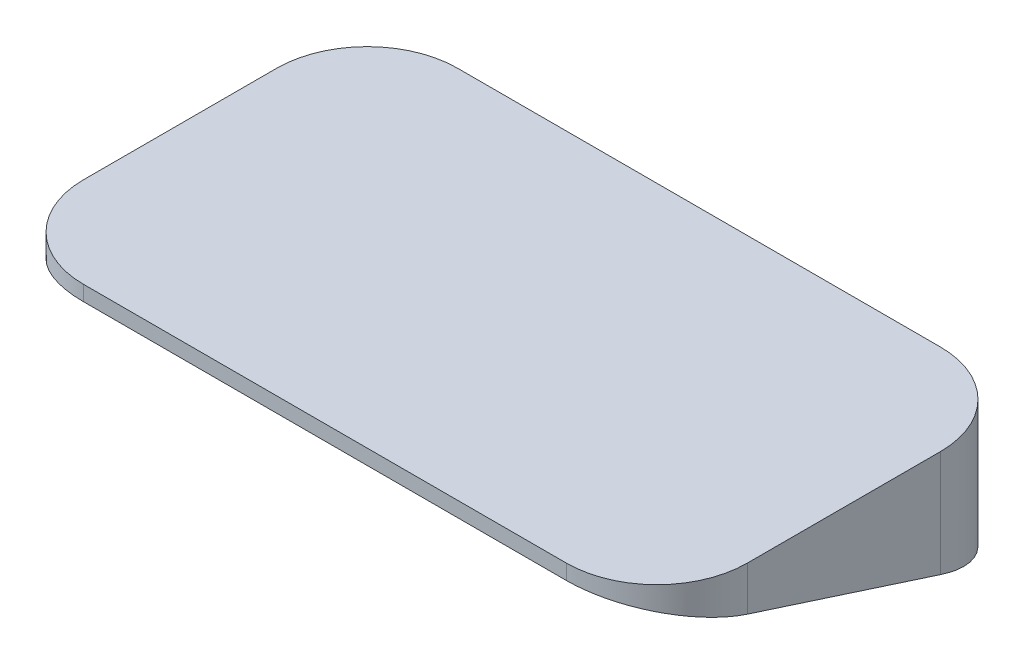
ISO-10303-21;
HEADER;
FILE_DESCRIPTION(('STEP AP214'),'2;1');
FILE_NAME('part.step','',(''),(''),'','','');
FILE_SCHEMA(('AUTOMOTIVE_DESIGN { 1 0 10303 214 1 1 1 1 }'));
ENDSEC;
DATA;
#1=APPLICATION_CONTEXT('core data for automotive mechanical design processes');
#2=APPLICATION_PROTOCOL_DEFINITION('international standard','automotive_design',2000,#1);
#3=PRODUCT_CONTEXT('',#1,'mechanical');
#4=PRODUCT('Part','Part','',(#3));
#5=PRODUCT_RELATED_PRODUCT_CATEGORY('part','',(#4));
#6=PRODUCT_DEFINITION_FORMATION('','',#4);
#7=PRODUCT_DEFINITION_CONTEXT('part definition',#1,'design');
#8=PRODUCT_DEFINITION('design','',#6,#7);
#9=PRODUCT_DEFINITION_SHAPE('','',#8);
#10=(LENGTH_UNIT() NAMED_UNIT(*) SI_UNIT(.MILLI.,.METRE.));
#11=(NAMED_UNIT(*) PLANE_ANGLE_UNIT() SI_UNIT($,.RADIAN.));
#12=(NAMED_UNIT(*) SI_UNIT($,.STERADIAN.) SOLID_ANGLE_UNIT());
#13=UNCERTAINTY_MEASURE_WITH_UNIT(LENGTH_MEASURE(1.E-05),#10,'distance_accuracy_value','');
#14=(GEOMETRIC_REPRESENTATION_CONTEXT(3) GLOBAL_UNCERTAINTY_ASSIGNED_CONTEXT((#13)) GLOBAL_UNIT_ASSIGNED_CONTEXT((#10,
#11,#12)) REPRESENTATION_CONTEXT('',''));
#15=CARTESIAN_POINT('',(0.,0.,0.));
#16=DIRECTION('',(0.,0.,1.));
#17=DIRECTION('',(1.,0.,0.));
#18=AXIS2_PLACEMENT_3D('',#15,#16,#17);
#19=CARTESIAN_POINT('',(80.,45.,32.));
#20=DIRECTION('',(0.,-1.,0.));
#21=DIRECTION('',(0.,0.,-1.));
#22=AXIS2_PLACEMENT_3D('',#19,#20,#21);
#23=CYLINDRICAL_SURFACE('',#22,30.);
#24=CARTESIAN_POINT('',(80.,30.3225806451613,32.));
#25=DIRECTION('',(0.,-0.951708617760551,0.307002779922758));
#26=DIRECTION('',(0.,-0.307002779922758,-0.951708617760551));
#27=AXIS2_PLACEMENT_3D('',#24,#25,#26);
#28=ELLIPSE('',#27,31.5222531772303,30.);
#29=CARTESIAN_POINT('',(110.,30.3225806451612,31.9999999999998));
#30=VERTEX_POINT('',#29);
#31=CARTESIAN_POINT('',(79.9999999999998,40.,62.));
#32=VERTEX_POINT('',#31);
#33=EDGE_CURVE('E161',#30,#32,#28,.T.);
#34=ORIENTED_EDGE('',*,*,#33,.F.);
#35=DIRECTION('',(0.,-1.,0.));
#36=VECTOR('',#35,1.);
#37=CARTESIAN_POINT('',(110.,45.,31.9999999999998));
#38=LINE('',#37,#36);
#39=CARTESIAN_POINT('',(110.,45.,31.9999999999998));
#40=VERTEX_POINT('',#39);
#41=EDGE_CURVE('E40',#40,#30,#38,.T.);
#42=ORIENTED_EDGE('',*,*,#41,.F.);
#43=CARTESIAN_POINT('',(80.,45.,32.));
#44=DIRECTION('',(0.,1.,0.));
#45=DIRECTION('',(0.,0.,1.));
#46=AXIS2_PLACEMENT_3D('',#43,#44,#45);
#47=CIRCLE('',#46,30.);
#48=CARTESIAN_POINT('',(79.9999999999998,45.,62.));
#49=VERTEX_POINT('',#48);
#50=EDGE_CURVE('E131',#49,#40,#47,.T.);
#51=ORIENTED_EDGE('',*,*,#50,.F.);
#52=DIRECTION('',(0.,-1.,0.));
#53=VECTOR('',#52,1.);
#54=CARTESIAN_POINT('',(79.9999999999998,45.,62.));
#55=LINE('',#54,#53);
#56=EDGE_CURVE('E125',#49,#32,#55,.T.);
#57=ORIENTED_EDGE('',*,*,#56,.T.);
#58=EDGE_LOOP('',(#34,#42,#51,#57));
#59=FACE_BOUND('',#58,.T.);
#60=ADVANCED_FACE('F33',(#59),#23,.T.);
#61=CARTESIAN_POINT('',(110.,45.,-31.9999999999998));
#62=DIRECTION('',(-1.,0.,0.));
#63=DIRECTION('',(0.,0.,1.));
#64=AXIS2_PLACEMENT_3D('',#61,#62,#63);
#65=PLANE('',#64);
#66=DIRECTION('',(0.,-0.307002779922758,-0.951708617760551));
#67=VECTOR('',#66,1.);
#68=CARTESIAN_POINT('',(110.,18.114985862394,-5.84354382657873));
#69=LINE('',#68,#67);
#70=CARTESIAN_POINT('',(110.,9.67741935483871,-32.));
#71=VERTEX_POINT('',#70);
#72=EDGE_CURVE('E153',#30,#71,#69,.T.);
#73=ORIENTED_EDGE('',*,*,#72,.T.);
#74=DIRECTION('',(0.,-1.,0.));
#75=VECTOR('',#74,1.);
#76=CARTESIAN_POINT('',(110.,45.,-31.9999999999998));
#77=LINE('',#76,#75);
#78=CARTESIAN_POINT('',(110.,45.,-31.9999999999998));
#79=VERTEX_POINT('',#78);
#80=EDGE_CURVE('E142',#79,#71,#77,.T.);
#81=ORIENTED_EDGE('',*,*,#80,.F.);
#82=DIRECTION('',(0.,0.,-1.));
#83=VECTOR('',#82,1.);
#84=CARTESIAN_POINT('',(110.,45.,-31.9999999999998));
#85=LINE('',#84,#83);
#86=EDGE_CURVE('E154',#40,#79,#85,.T.);
#87=ORIENTED_EDGE('',*,*,#86,.F.);
#88=ORIENTED_EDGE('',*,*,#41,.T.);
#89=EDGE_LOOP('',(#73,#81,#87,#88));
#90=FACE_BOUND('',#89,.T.);
#91=ADVANCED_FACE('F149',(#90),#65,.F.);
#92=CARTESIAN_POINT('',(80.,45.,-32.));
#93=DIRECTION('',(0.,-1.,0.));
#94=DIRECTION('',(0.,0.,-1.));
#95=AXIS2_PLACEMENT_3D('',#92,#93,#94);
#96=CYLINDRICAL_SURFACE('',#95,30.);
#97=CARTESIAN_POINT('',(80.,9.67741935483871,-32.));
#98=DIRECTION('',(0.,-0.951708617760551,0.307002779922758));
#99=DIRECTION('',(0.,-0.307002779922758,-0.951708617760551));
#100=AXIS2_PLACEMENT_3D('',#97,#98,#99);
#101=ELLIPSE('',#100,31.5222531772303,30.);
#102=CARTESIAN_POINT('',(79.9999999999998,0.,-62.));
#103=VERTEX_POINT('',#102);
#104=EDGE_CURVE('E166',#103,#71,#101,.T.);
#105=ORIENTED_EDGE('',*,*,#104,.F.);
#106=DIRECTION('',(0.,-1.,0.));
#107=VECTOR('',#106,1.);
#108=CARTESIAN_POINT('',(79.9999999999998,45.,-62.));
#109=LINE('',#108,#107);
#110=CARTESIAN_POINT('',(79.9999999999998,45.,-62.));
#111=VERTEX_POINT('',#110);
#112=EDGE_CURVE('E139',#111,#103,#109,.T.);
#113=ORIENTED_EDGE('',*,*,#112,.F.);
#114=CARTESIAN_POINT('',(80.,45.,-32.));
#115=DIRECTION('',(0.,1.,0.));
#116=DIRECTION('',(0.,0.,-1.));
#117=AXIS2_PLACEMENT_3D('',#114,#115,#116);
#118=CIRCLE('',#117,30.);
#119=EDGE_CURVE('E219',#79,#111,#118,.T.);
#120=ORIENTED_EDGE('',*,*,#119,.F.);
#121=ORIENTED_EDGE('',*,*,#80,.T.);
#122=EDGE_LOOP('',(#105,#113,#120,#121));
#123=FACE_BOUND('',#122,.T.);
#124=ADVANCED_FACE('F326',(#123),#96,.T.);
#125=CARTESIAN_POINT('',(-80.,45.,-32.));
#126=DIRECTION('',(0.,-1.,0.));
#127=DIRECTION('',(0.,0.,-1.));
#128=AXIS2_PLACEMENT_3D('',#125,#126,#127);
#129=CYLINDRICAL_SURFACE('',#128,30.);
#130=CARTESIAN_POINT('',(-80.,9.6774193548387,-32.));
#131=DIRECTION('',(0.,-0.951708617760551,0.307002779922758));
#132=DIRECTION('',(0.,-0.307002779922758,-0.951708617760551));
#133=AXIS2_PLACEMENT_3D('',#130,#131,#132);
#134=ELLIPSE('',#133,31.5222531772303,30.);
#135=CARTESIAN_POINT('',(-110.,9.67741935483876,-31.9999999999998));
#136=VERTEX_POINT('',#135);
#137=CARTESIAN_POINT('',(-79.9999999999998,0.,-62.));
#138=VERTEX_POINT('',#137);
#139=EDGE_CURVE('E68',#136,#138,#134,.T.);
#140=ORIENTED_EDGE('',*,*,#139,.F.);
#141=DIRECTION('',(0.,-1.,0.));
#142=VECTOR('',#141,1.);
#143=CARTESIAN_POINT('',(-110.,45.,-31.9999999999998));
#144=LINE('',#143,#142);
#145=CARTESIAN_POINT('',(-110.,45.,-31.9999999999998));
#146=VERTEX_POINT('',#145);
#147=EDGE_CURVE('E119',#146,#136,#144,.T.);
#148=ORIENTED_EDGE('',*,*,#147,.F.);
#149=CARTESIAN_POINT('',(-80.,45.,-32.));
#150=DIRECTION('',(0.,1.,0.));
#151=DIRECTION('',(0.,0.,1.));
#152=AXIS2_PLACEMENT_3D('',#149,#150,#151);
#153=CIRCLE('',#152,30.);
#154=CARTESIAN_POINT('',(-79.9999999999998,45.,-62.));
#155=VERTEX_POINT('',#154);
#156=EDGE_CURVE('E106',#155,#146,#153,.T.);
#157=ORIENTED_EDGE('',*,*,#156,.F.);
#158=DIRECTION('',(0.,-1.,0.));
#159=VECTOR('',#158,1.);
#160=CARTESIAN_POINT('',(-79.9999999999998,45.,-62.));
#161=LINE('',#160,#159);
#162=EDGE_CURVE('E136',#155,#138,#161,.T.);
#163=ORIENTED_EDGE('',*,*,#162,.T.);
#164=EDGE_LOOP('',(#140,#148,#157,#163));
#165=FACE_BOUND('',#164,.T.);
#166=ADVANCED_FACE('F229',(#165),#129,.T.);
#167=CARTESIAN_POINT('',(-110.,45.,-31.9999999999998));
#168=DIRECTION('',(1.,0.,0.));
#169=DIRECTION('',(0.,0.,-1.));
#170=AXIS2_PLACEMENT_3D('',#167,#168,#169);
#171=PLANE('',#170);
#172=DIRECTION('',(0.,-0.307002779922758,-0.951708617760551));
#173=VECTOR('',#172,1.);
#174=CARTESIAN_POINT('',(-110.,13.0065975494817,-21.6795475966068));
#175=LINE('',#174,#173);
#176=CARTESIAN_POINT('',(-110.,30.3225806451612,31.9999999999998));
#177=VERTEX_POINT('',#176);
#178=EDGE_CURVE('E116',#177,#136,#175,.T.);
#179=ORIENTED_EDGE('',*,*,#178,.F.);
#180=DIRECTION('',(0.,-1.,0.));
#181=VECTOR('',#180,1.);
#182=CARTESIAN_POINT('',(-110.,45.,31.9999999999998));
#183=LINE('',#182,#181);
#184=CARTESIAN_POINT('',(-110.,45.,31.9999999999998));
#185=VERTEX_POINT('',#184);
#186=EDGE_CURVE('E113',#185,#177,#183,.T.);
#187=ORIENTED_EDGE('',*,*,#186,.F.);
#188=DIRECTION('',(0.,0.,1.));
#189=VECTOR('',#188,1.);
#190=CARTESIAN_POINT('',(-110.,45.,-31.9999999999998));
#191=LINE('',#190,#189);
#192=EDGE_CURVE('E99',#146,#185,#191,.T.);
#193=ORIENTED_EDGE('',*,*,#192,.F.);
#194=ORIENTED_EDGE('',*,*,#147,.T.);
#195=EDGE_LOOP('',(#179,#187,#193,#194));
#196=FACE_BOUND('',#195,.T.);
#197=ADVANCED_FACE('F114',(#196),#171,.F.);
#198=CARTESIAN_POINT('',(-80.,45.,32.));
#199=DIRECTION('',(0.,-1.,0.));
#200=DIRECTION('',(0.,0.,-1.));
#201=AXIS2_PLACEMENT_3D('',#198,#199,#200);
#202=CYLINDRICAL_SURFACE('',#201,30.);
#203=CARTESIAN_POINT('',(-80.,30.3225806451613,32.));
#204=DIRECTION('',(0.,-0.951708617760551,0.307002779922758));
#205=DIRECTION('',(0.,-0.307002779922758,-0.951708617760551));
#206=AXIS2_PLACEMENT_3D('',#203,#204,#205);
#207=ELLIPSE('',#206,31.5222531772303,30.);
#208=CARTESIAN_POINT('',(-79.9999999999998,40.,62.));
#209=VERTEX_POINT('',#208);
#210=EDGE_CURVE('E290',#209,#177,#207,.T.);
#211=ORIENTED_EDGE('',*,*,#210,.F.);
#212=DIRECTION('',(0.,-1.,0.));
#213=VECTOR('',#212,1.);
#214=CARTESIAN_POINT('',(-79.9999999999998,45.,62.));
#215=LINE('',#214,#213);
#216=CARTESIAN_POINT('',(-79.9999999999998,45.,62.));
#217=VERTEX_POINT('',#216);
#218=EDGE_CURVE('E120',#217,#209,#215,.T.);
#219=ORIENTED_EDGE('',*,*,#218,.F.);
#220=CARTESIAN_POINT('',(-80.,45.,32.));
#221=DIRECTION('',(0.,1.,0.));
#222=DIRECTION('',(0.,0.,1.));
#223=AXIS2_PLACEMENT_3D('',#220,#221,#222);
#224=CIRCLE('',#223,30.);
#225=EDGE_CURVE('E103',#185,#217,#224,.T.);
#226=ORIENTED_EDGE('',*,*,#225,.F.);
#227=ORIENTED_EDGE('',*,*,#186,.T.);
#228=EDGE_LOOP('',(#211,#219,#226,#227));
#229=FACE_BOUND('',#228,.T.);
#230=ADVANCED_FACE('F122',(#229),#202,.T.);
#231=CARTESIAN_POINT('',(-79.9999999999998,45.,62.));
#232=DIRECTION('',(0.,0.,-1.));
#233=DIRECTION('',(-1.,0.,0.));
#234=AXIS2_PLACEMENT_3D('',#231,#232,#233);
#235=PLANE('',#234);
#236=DIRECTION('',(1.,0.,0.));
#237=VECTOR('',#236,1.);
#238=CARTESIAN_POINT('',(-154.,40.,62.));
#239=LINE('',#238,#237);
#240=EDGE_CURVE('E308',#209,#32,#239,.T.);
#241=ORIENTED_EDGE('',*,*,#240,.T.);
#242=ORIENTED_EDGE('',*,*,#56,.F.);
#243=DIRECTION('',(1.,0.,0.));
#244=VECTOR('',#243,1.);
#245=CARTESIAN_POINT('',(-79.9999999999998,45.,62.));
#246=LINE('',#245,#244);
#247=EDGE_CURVE('E55',#217,#49,#246,.T.);
#248=ORIENTED_EDGE('',*,*,#247,.F.);
#249=ORIENTED_EDGE('',*,*,#218,.T.);
#250=EDGE_LOOP('',(#241,#242,#248,#249));
#251=FACE_BOUND('',#250,.T.);
#252=ADVANCED_FACE('F318',(#251),#235,.F.);
#253=CARTESIAN_POINT('',(-79.9999999999998,45.,-62.));
#254=DIRECTION('',(0.,0.,1.));
#255=DIRECTION('',(1.,0.,0.));
#256=AXIS2_PLACEMENT_3D('',#253,#254,#255);
#257=PLANE('',#256);
#258=DIRECTION('',(-1.,0.,0.));
#259=VECTOR('',#258,1.);
#260=CARTESIAN_POINT('',(-79.9999999999998,0.,-62.));
#261=LINE('',#260,#259);
#262=EDGE_CURVE('E129',#103,#138,#261,.T.);
#263=ORIENTED_EDGE('',*,*,#262,.T.);
#264=ORIENTED_EDGE('',*,*,#162,.F.);
#265=DIRECTION('',(-1.,0.,0.));
#266=VECTOR('',#265,1.);
#267=CARTESIAN_POINT('',(-79.9999999999998,45.,-62.));
#268=LINE('',#267,#266);
#269=EDGE_CURVE('E221',#111,#155,#268,.T.);
#270=ORIENTED_EDGE('',*,*,#269,.F.);
#271=ORIENTED_EDGE('',*,*,#112,.T.);
#272=EDGE_LOOP('',(#263,#264,#270,#271));
#273=FACE_BOUND('',#272,.T.);
#274=ADVANCED_FACE('F227',(#273),#257,.F.);
#275=CARTESIAN_POINT('',(80.,45.,32.));
#276=DIRECTION('',(0.,1.,0.));
#277=DIRECTION('',(0.,0.,1.));
#278=AXIS2_PLACEMENT_3D('',#275,#276,#277);
#279=PLANE('',#278);
#280=ORIENTED_EDGE('',*,*,#50,.T.);
#281=ORIENTED_EDGE('',*,*,#86,.T.);
#282=ORIENTED_EDGE('',*,*,#119,.T.);
#283=ORIENTED_EDGE('',*,*,#269,.T.);
#284=ORIENTED_EDGE('',*,*,#156,.T.);
#285=ORIENTED_EDGE('',*,*,#192,.T.);
#286=ORIENTED_EDGE('',*,*,#225,.T.);
#287=ORIENTED_EDGE('',*,*,#247,.T.);
#288=EDGE_LOOP('',(#280,#281,#282,#283,#284,#285,#286,#287));
#289=FACE_BOUND('',#288,.T.);
#290=ADVANCED_FACE('F101',(#289),#279,.T.);
#291=CARTESIAN_POINT('',(-154.,18.114985862394,-5.84354382657867));
#292=DIRECTION('',(0.,-0.951708617760551,0.307002779922758));
#293=DIRECTION('',(0.,-0.307002779922758,-0.951708617760551));
#294=AXIS2_PLACEMENT_3D('',#291,#292,#293);
#295=PLANE('',#294);
#296=CARTESIAN_POINT('',(80.,30.3225806451613,32.));
#297=DIRECTION('',(0.,-0.951708617760551,0.307002779922758));
#298=DIRECTION('',(0.,-0.307002779922758,-0.951708617760551));
#299=AXIS2_PLACEMENT_3D('',#296,#297,#298);
#300=ELLIPSE('',#299,29.4207696320816,28.);
#301=CARTESIAN_POINT('',(79.9999999999998,39.3548387096774,60.));
#302=VERTEX_POINT('',#301);
#303=CARTESIAN_POINT('',(108.,30.3225806451612,31.9999999999998));
#304=VERTEX_POINT('',#303);
#305=EDGE_CURVE('E285',#302,#304,#300,.F.);
#306=ORIENTED_EDGE('',*,*,#305,.T.);
#307=DIRECTION('',(0.,-0.307002779922758,-0.951708617760551));
#308=VECTOR('',#307,1.);
#309=CARTESIAN_POINT('',(108.,12.8180961357211,-22.2639019792647));
#310=LINE('',#309,#308);
#311=CARTESIAN_POINT('',(108.,9.67741935483877,-31.9999999999998));
#312=VERTEX_POINT('',#311);
#313=EDGE_CURVE('E287',#304,#312,#310,.T.);
#314=ORIENTED_EDGE('',*,*,#313,.T.);
#315=CARTESIAN_POINT('',(80.,9.6774193548387,-32.));
#316=DIRECTION('',(0.,-0.951708617760551,0.307002779922758));
#317=DIRECTION('',(0.,-0.307002779922758,-0.951708617760551));
#318=AXIS2_PLACEMENT_3D('',#315,#316,#317);
#319=ELLIPSE('',#318,29.4207696320816,28.);
#320=CARTESIAN_POINT('',(79.9999999999998,0.645161290322574,-60.));
#321=VERTEX_POINT('',#320);
#322=EDGE_CURVE('E293',#312,#321,#319,.F.);
#323=ORIENTED_EDGE('',*,*,#322,.T.);
#324=DIRECTION('',(-1.,0.,0.));
#325=VECTOR('',#324,1.);
#326=CARTESIAN_POINT('',(-79.9999999999998,0.645161290322563,-60.));
#327=LINE('',#326,#325);
#328=CARTESIAN_POINT('',(-79.9999999999998,0.64516129032257,-60.));
#329=VERTEX_POINT('',#328);
#330=EDGE_CURVE('E259',#321,#329,#327,.T.);
#331=ORIENTED_EDGE('',*,*,#330,.T.);
#332=CARTESIAN_POINT('',(-80.,9.67741935483869,-32.));
#333=DIRECTION('',(0.,-0.951708617760551,0.307002779922758));
#334=DIRECTION('',(0.,-0.307002779922758,-0.951708617760551));
#335=AXIS2_PLACEMENT_3D('',#332,#333,#334);
#336=ELLIPSE('',#335,29.4207696320816,28.);
#337=CARTESIAN_POINT('',(-108.,9.67741935483877,-31.9999999999998));
#338=VERTEX_POINT('',#337);
#339=EDGE_CURVE('E273',#329,#338,#336,.F.);
#340=ORIENTED_EDGE('',*,*,#339,.T.);
#341=DIRECTION('',(0.,0.307002779922758,0.951708617760551));
#342=VECTOR('',#341,1.);
#343=CARTESIAN_POINT('',(-108.,31.5174363807728,35.7040527803956));
#344=LINE('',#343,#342);
#345=CARTESIAN_POINT('',(-108.,30.3225806451612,31.9999999999998));
#346=VERTEX_POINT('',#345);
#347=EDGE_CURVE('E305',#338,#346,#344,.T.);
#348=ORIENTED_EDGE('',*,*,#347,.T.);
#349=CARTESIAN_POINT('',(-80.,30.3225806451613,32.));
#350=DIRECTION('',(0.,-0.951708617760551,0.307002779922758));
#351=DIRECTION('',(0.,-0.307002779922758,-0.951708617760551));
#352=AXIS2_PLACEMENT_3D('',#349,#350,#351);
#353=ELLIPSE('',#352,29.4207696320816,28.);
#354=CARTESIAN_POINT('',(-79.9999999999998,39.3548387096774,60.));
#355=VERTEX_POINT('',#354);
#356=EDGE_CURVE('E46',#346,#355,#353,.F.);
#357=ORIENTED_EDGE('',*,*,#356,.T.);
#358=DIRECTION('',(1.,0.,0.));
#359=VECTOR('',#358,1.);
#360=CARTESIAN_POINT('',(79.9999999999998,39.3548387096774,60.));
#361=LINE('',#360,#359);
#362=EDGE_CURVE('E11',#355,#302,#361,.T.);
#363=ORIENTED_EDGE('',*,*,#362,.T.);
#364=EDGE_LOOP('',(#306,#314,#323,#331,#340,#348,#357,#363));
#365=FACE_BOUND('',#364,.T.);
#366=ORIENTED_EDGE('',*,*,#33,.T.);
#367=ORIENTED_EDGE('',*,*,#240,.F.);
#368=ORIENTED_EDGE('',*,*,#210,.T.);
#369=ORIENTED_EDGE('',*,*,#178,.T.);
#370=ORIENTED_EDGE('',*,*,#139,.T.);
#371=ORIENTED_EDGE('',*,*,#262,.F.);
#372=ORIENTED_EDGE('',*,*,#104,.T.);
#373=ORIENTED_EDGE('',*,*,#72,.F.);
#374=EDGE_LOOP('',(#366,#367,#368,#369,#370,#371,#372,#373));
#375=FACE_BOUND('',#374,.T.);
#376=ADVANCED_FACE('F286',(#365,#375),#295,.T.);
#377=CARTESIAN_POINT('',(80.,43.,32.));
#378=DIRECTION('',(0.,-1.,0.));
#379=DIRECTION('',(0.,0.,-1.));
#380=AXIS2_PLACEMENT_3D('',#377,#378,#379);
#381=PLANE('',#380);
#382=CARTESIAN_POINT('',(80.,43.,32.));
#383=DIRECTION('',(0.,-1.,0.));
#384=DIRECTION('',(0.,0.,-1.));
#385=AXIS2_PLACEMENT_3D('',#382,#383,#384);
#386=CIRCLE('',#385,28.);
#387=CARTESIAN_POINT('',(108.,43.,31.9999999999998));
#388=VERTEX_POINT('',#387);
#389=CARTESIAN_POINT('',(79.9999999999998,43.,60.));
#390=VERTEX_POINT('',#389);
#391=EDGE_CURVE('E165',#388,#390,#386,.T.);
#392=ORIENTED_EDGE('',*,*,#391,.T.);
#393=DIRECTION('',(-1.,0.,0.));
#394=VECTOR('',#393,1.);
#395=CARTESIAN_POINT('',(79.9999999999998,43.,60.));
#396=LINE('',#395,#394);
#397=CARTESIAN_POINT('',(-79.9999999999998,43.,60.));
#398=VERTEX_POINT('',#397);
#399=EDGE_CURVE('E169',#390,#398,#396,.T.);
#400=ORIENTED_EDGE('',*,*,#399,.T.);
#401=CARTESIAN_POINT('',(-80.,43.,32.));
#402=DIRECTION('',(0.,-1.,0.));
#403=DIRECTION('',(0.,0.,-1.));
#404=AXIS2_PLACEMENT_3D('',#401,#402,#403);
#405=CIRCLE('',#404,28.);
#406=CARTESIAN_POINT('',(-108.,43.,31.9999999999998));
#407=VERTEX_POINT('',#406);
#408=EDGE_CURVE('E177',#398,#407,#405,.T.);
#409=ORIENTED_EDGE('',*,*,#408,.T.);
#410=DIRECTION('',(0.,0.,-1.));
#411=VECTOR('',#410,1.);
#412=CARTESIAN_POINT('',(-108.,43.,31.9999999999998));
#413=LINE('',#412,#411);
#414=CARTESIAN_POINT('',(-108.,43.,-31.9999999999998));
#415=VERTEX_POINT('',#414);
#416=EDGE_CURVE('E180',#407,#415,#413,.T.);
#417=ORIENTED_EDGE('',*,*,#416,.T.);
#418=CARTESIAN_POINT('',(-80.,43.,-32.));
#419=DIRECTION('',(0.,-1.,0.));
#420=DIRECTION('',(0.,0.,-1.));
#421=AXIS2_PLACEMENT_3D('',#418,#419,#420);
#422=CIRCLE('',#421,28.);
#423=CARTESIAN_POINT('',(-79.9999999999998,43.,-60.));
#424=VERTEX_POINT('',#423);
#425=EDGE_CURVE('E183',#415,#424,#422,.T.);
#426=ORIENTED_EDGE('',*,*,#425,.T.);
#427=DIRECTION('',(1.,0.,0.));
#428=VECTOR('',#427,1.);
#429=CARTESIAN_POINT('',(-79.9999999999998,43.,-60.));
#430=LINE('',#429,#428);
#431=CARTESIAN_POINT('',(79.9999999999998,43.,-60.));
#432=VERTEX_POINT('',#431);
#433=EDGE_CURVE('E186',#424,#432,#430,.T.);
#434=ORIENTED_EDGE('',*,*,#433,.T.);
#435=CARTESIAN_POINT('',(80.,43.,-32.));
#436=DIRECTION('',(0.,-1.,0.));
#437=DIRECTION('',(0.,0.,-1.));
#438=AXIS2_PLACEMENT_3D('',#435,#436,#437);
#439=CIRCLE('',#438,28.);
#440=CARTESIAN_POINT('',(108.,43.,-31.9999999999998));
#441=VERTEX_POINT('',#440);
#442=EDGE_CURVE('E189',#432,#441,#439,.T.);
#443=ORIENTED_EDGE('',*,*,#442,.T.);
#444=DIRECTION('',(0.,0.,1.));
#445=VECTOR('',#444,1.);
#446=CARTESIAN_POINT('',(108.,43.,-31.9999999999998));
#447=LINE('',#446,#445);
#448=EDGE_CURVE('E192',#441,#388,#447,.T.);
#449=ORIENTED_EDGE('',*,*,#448,.T.);
#450=EDGE_LOOP('',(#392,#400,#409,#417,#426,#434,#443,#449));
#451=FACE_BOUND('',#450,.T.);
#452=ADVANCED_FACE('F264',(#451),#381,.T.);
#453=CARTESIAN_POINT('',(79.9999999999998,43.,60.));
#454=DIRECTION('',(0.,0.,1.));
#455=DIRECTION('',(1.,0.,0.));
#456=AXIS2_PLACEMENT_3D('',#453,#454,#455);
#457=PLANE('',#456);
#458=ORIENTED_EDGE('',*,*,#362,.F.);
#459=DIRECTION('',(0.,-1.,0.));
#460=VECTOR('',#459,1.);
#461=CARTESIAN_POINT('',(-79.9999999999998,43.,60.));
#462=LINE('',#461,#460);
#463=EDGE_CURVE('E212',#398,#355,#462,.T.);
#464=ORIENTED_EDGE('',*,*,#463,.F.);
#465=ORIENTED_EDGE('',*,*,#399,.F.);
#466=DIRECTION('',(0.,-1.,0.));
#467=VECTOR('',#466,1.);
#468=CARTESIAN_POINT('',(79.9999999999998,43.,60.));
#469=LINE('',#468,#467);
#470=EDGE_CURVE('E195',#390,#302,#469,.T.);
#471=ORIENTED_EDGE('',*,*,#470,.T.);
#472=EDGE_LOOP('',(#458,#464,#465,#471));
#473=FACE_BOUND('',#472,.T.);
#474=ADVANCED_FACE('F299',(#473),#457,.F.);
#475=CARTESIAN_POINT('',(-80.,43.,32.));
#476=DIRECTION('',(0.,-1.,0.));
#477=DIRECTION('',(0.,0.,-1.));
#478=AXIS2_PLACEMENT_3D('',#475,#476,#477);
#479=CYLINDRICAL_SURFACE('',#478,28.);
#480=ORIENTED_EDGE('',*,*,#356,.F.);
#481=DIRECTION('',(0.,-1.,0.));
#482=VECTOR('',#481,1.);
#483=CARTESIAN_POINT('',(-108.,43.,31.9999999999998));
#484=LINE('',#483,#482);
#485=EDGE_CURVE('E209',#407,#346,#484,.T.);
#486=ORIENTED_EDGE('',*,*,#485,.F.);
#487=ORIENTED_EDGE('',*,*,#408,.F.);
#488=ORIENTED_EDGE('',*,*,#463,.T.);
#489=EDGE_LOOP('',(#480,#486,#487,#488));
#490=FACE_BOUND('',#489,.T.);
#491=ADVANCED_FACE('F301',(#490),#479,.F.);
#492=CARTESIAN_POINT('',(-108.,43.,31.9999999999998));
#493=DIRECTION('',(-1.,0.,0.));
#494=DIRECTION('',(0.,0.,1.));
#495=AXIS2_PLACEMENT_3D('',#492,#493,#494);
#496=PLANE('',#495);
#497=ORIENTED_EDGE('',*,*,#347,.F.);
#498=DIRECTION('',(0.,-1.,0.));
#499=VECTOR('',#498,1.);
#500=CARTESIAN_POINT('',(-108.,43.,-31.9999999999998));
#501=LINE('',#500,#499);
#502=EDGE_CURVE('E206',#415,#338,#501,.T.);
#503=ORIENTED_EDGE('',*,*,#502,.F.);
#504=ORIENTED_EDGE('',*,*,#416,.F.);
#505=ORIENTED_EDGE('',*,*,#485,.T.);
#506=EDGE_LOOP('',(#497,#503,#504,#505));
#507=FACE_BOUND('',#506,.T.);
#508=ADVANCED_FACE('F304',(#507),#496,.F.);
#509=CARTESIAN_POINT('',(-80.,43.,-32.));
#510=DIRECTION('',(0.,-1.,0.));
#511=DIRECTION('',(0.,0.,-1.));
#512=AXIS2_PLACEMENT_3D('',#509,#510,#511);
#513=CYLINDRICAL_SURFACE('',#512,28.);
#514=ORIENTED_EDGE('',*,*,#339,.F.);
#515=DIRECTION('',(0.,-1.,0.));
#516=VECTOR('',#515,1.);
#517=CARTESIAN_POINT('',(-79.9999999999998,43.,-60.));
#518=LINE('',#517,#516);
#519=EDGE_CURVE('E203',#424,#329,#518,.T.);
#520=ORIENTED_EDGE('',*,*,#519,.F.);
#521=ORIENTED_EDGE('',*,*,#425,.F.);
#522=ORIENTED_EDGE('',*,*,#502,.T.);
#523=EDGE_LOOP('',(#514,#520,#521,#522));
#524=FACE_BOUND('',#523,.T.);
#525=ADVANCED_FACE('F269',(#524),#513,.F.);
#526=CARTESIAN_POINT('',(-79.9999999999998,43.,-60.));
#527=DIRECTION('',(0.,0.,-1.));
#528=DIRECTION('',(-1.,0.,0.));
#529=AXIS2_PLACEMENT_3D('',#526,#527,#528);
#530=PLANE('',#529);
#531=ORIENTED_EDGE('',*,*,#330,.F.);
#532=DIRECTION('',(0.,-1.,0.));
#533=VECTOR('',#532,1.);
#534=CARTESIAN_POINT('',(79.9999999999998,43.,-60.));
#535=LINE('',#534,#533);
#536=EDGE_CURVE('E200',#432,#321,#535,.T.);
#537=ORIENTED_EDGE('',*,*,#536,.F.);
#538=ORIENTED_EDGE('',*,*,#433,.F.);
#539=ORIENTED_EDGE('',*,*,#519,.T.);
#540=EDGE_LOOP('',(#531,#537,#538,#539));
#541=FACE_BOUND('',#540,.T.);
#542=ADVANCED_FACE('F256',(#541),#530,.F.);
#543=CARTESIAN_POINT('',(80.,43.,-32.));
#544=DIRECTION('',(0.,-1.,0.));
#545=DIRECTION('',(0.,0.,-1.));
#546=AXIS2_PLACEMENT_3D('',#543,#544,#545);
#547=CYLINDRICAL_SURFACE('',#546,28.);
#548=ORIENTED_EDGE('',*,*,#322,.F.);
#549=DIRECTION('',(0.,-1.,0.));
#550=VECTOR('',#549,1.);
#551=CARTESIAN_POINT('',(108.,43.,-31.9999999999998));
#552=LINE('',#551,#550);
#553=EDGE_CURVE('E197',#441,#312,#552,.T.);
#554=ORIENTED_EDGE('',*,*,#553,.F.);
#555=ORIENTED_EDGE('',*,*,#442,.F.);
#556=ORIENTED_EDGE('',*,*,#536,.T.);
#557=EDGE_LOOP('',(#548,#554,#555,#556));
#558=FACE_BOUND('',#557,.T.);
#559=ADVANCED_FACE('F262',(#558),#547,.F.);
#560=CARTESIAN_POINT('',(108.,43.,-31.9999999999998));
#561=DIRECTION('',(1.,0.,0.));
#562=DIRECTION('',(0.,0.,-1.));
#563=AXIS2_PLACEMENT_3D('',#560,#561,#562);
#564=PLANE('',#563);
#565=ORIENTED_EDGE('',*,*,#313,.F.);
#566=DIRECTION('',(0.,-1.,0.));
#567=VECTOR('',#566,1.);
#568=CARTESIAN_POINT('',(108.,43.,31.9999999999998));
#569=LINE('',#568,#567);
#570=EDGE_CURVE('E80',#388,#304,#569,.T.);
#571=ORIENTED_EDGE('',*,*,#570,.F.);
#572=ORIENTED_EDGE('',*,*,#448,.F.);
#573=ORIENTED_EDGE('',*,*,#553,.T.);
#574=EDGE_LOOP('',(#565,#571,#572,#573));
#575=FACE_BOUND('',#574,.T.);
#576=ADVANCED_FACE('F292',(#575),#564,.F.);
#577=CARTESIAN_POINT('',(80.,43.,32.));
#578=DIRECTION('',(0.,-1.,0.));
#579=DIRECTION('',(0.,0.,-1.));
#580=AXIS2_PLACEMENT_3D('',#577,#578,#579);
#581=CYLINDRICAL_SURFACE('',#580,28.);
#582=ORIENTED_EDGE('',*,*,#305,.F.);
#583=ORIENTED_EDGE('',*,*,#470,.F.);
#584=ORIENTED_EDGE('',*,*,#391,.F.);
#585=ORIENTED_EDGE('',*,*,#570,.T.);
#586=EDGE_LOOP('',(#582,#583,#584,#585));
#587=FACE_BOUND('',#586,.T.);
#588=ADVANCED_FACE('F295',(#587),#581,.F.);
#589=CLOSED_SHELL('',(#60,#91,#124,#166,#197,#230,#252,#274,#290,#376,#452,#474,#491,#508,#525,
#542,#559,#576,#588));
#590=MANIFOLD_SOLID_BREP('B2',#589);
#591=ADVANCED_BREP_SHAPE_REPRESENTATION('',(#18,#590),#14);
#592=SHAPE_DEFINITION_REPRESENTATION(#9,#591);
ENDSEC;
END-ISO-10303-21;
